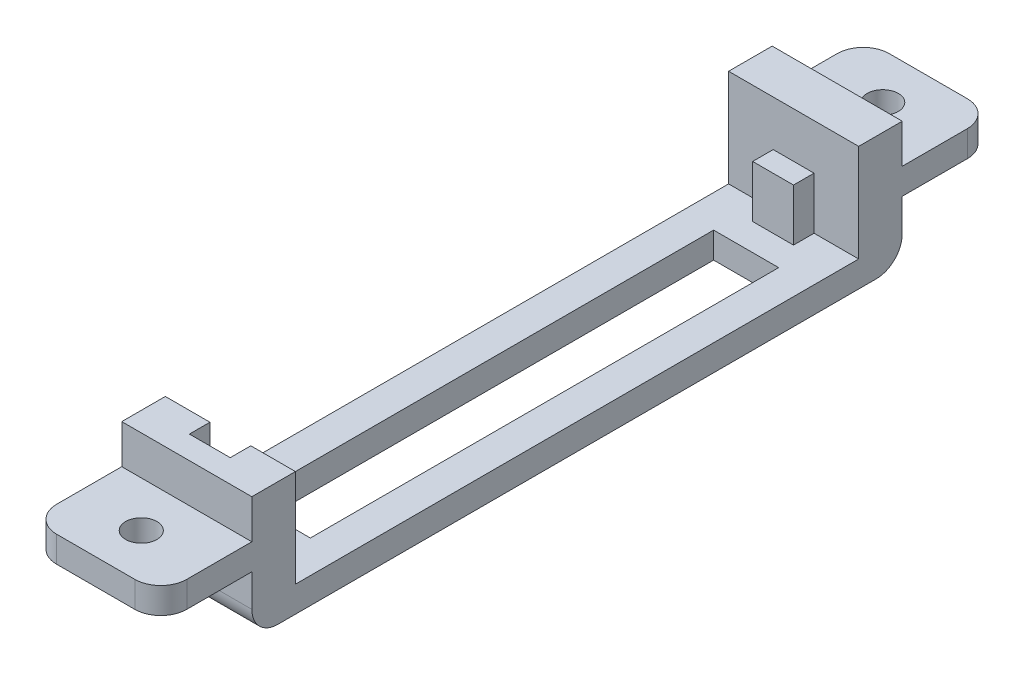
ISO-10303-21;
HEADER;
FILE_DESCRIPTION(('STEP AP214'),'2;1');
FILE_NAME('part.step','',(''),(''),'','','');
FILE_SCHEMA(('AUTOMOTIVE_DESIGN { 1 0 10303 214 1 1 1 1 }'));
ENDSEC;
DATA;
#1=APPLICATION_CONTEXT('core data for automotive mechanical design processes');
#2=APPLICATION_PROTOCOL_DEFINITION('international standard','automotive_design',2000,#1);
#3=PRODUCT_CONTEXT('',#1,'mechanical');
#4=PRODUCT('Part','Part','',(#3));
#5=PRODUCT_RELATED_PRODUCT_CATEGORY('part','',(#4));
#6=PRODUCT_DEFINITION_FORMATION('','',#4);
#7=PRODUCT_DEFINITION_CONTEXT('part definition',#1,'design');
#8=PRODUCT_DEFINITION('design','',#6,#7);
#9=PRODUCT_DEFINITION_SHAPE('','',#8);
#10=(LENGTH_UNIT() NAMED_UNIT(*) SI_UNIT(.MILLI.,.METRE.));
#11=(NAMED_UNIT(*) PLANE_ANGLE_UNIT() SI_UNIT($,.RADIAN.));
#12=(NAMED_UNIT(*) SI_UNIT($,.STERADIAN.) SOLID_ANGLE_UNIT());
#13=UNCERTAINTY_MEASURE_WITH_UNIT(LENGTH_MEASURE(1.E-05),#10,'distance_accuracy_value','');
#14=(GEOMETRIC_REPRESENTATION_CONTEXT(3) GLOBAL_UNCERTAINTY_ASSIGNED_CONTEXT((#13)) GLOBAL_UNIT_ASSIGNED_CONTEXT((#10,
#11,#12)) REPRESENTATION_CONTEXT('',''));
#15=CARTESIAN_POINT('',(0.,0.,0.));
#16=DIRECTION('',(0.,0.,1.));
#17=DIRECTION('',(1.,0.,0.));
#18=AXIS2_PLACEMENT_3D('',#15,#16,#17);
#19=CARTESIAN_POINT('',(-6.35,2.54,31.75));
#20=DIRECTION('',(0.,0.,-1.));
#21=DIRECTION('',(-1.,0.,0.));
#22=AXIS2_PLACEMENT_3D('',#19,#20,#21);
#23=PLANE('',#22);
#24=DIRECTION('',(-1.,0.,0.));
#25=VECTOR('',#24,1.);
#26=CARTESIAN_POINT('',(6.35,8.255,31.75));
#27=LINE('',#26,#25);
#28=CARTESIAN_POINT('',(6.35,8.255,31.75));
#29=VERTEX_POINT('',#28);
#30=CARTESIAN_POINT('',(-6.35,8.255,31.75));
#31=VERTEX_POINT('',#30);
#32=EDGE_CURVE('E363',#29,#31,#27,.T.);
#33=ORIENTED_EDGE('',*,*,#32,.F.);
#34=DIRECTION('',(0.,-1.,0.));
#35=VECTOR('',#34,1.);
#36=CARTESIAN_POINT('',(6.35,2.54,31.75));
#37=LINE('',#36,#35);
#38=CARTESIAN_POINT('',(6.35000000000002,12.065,31.75));
#39=VERTEX_POINT('',#38);
#40=EDGE_CURVE('E278',#39,#29,#37,.T.);
#41=ORIENTED_EDGE('',*,*,#40,.F.);
#42=DIRECTION('',(1.,0.,0.));
#43=VECTOR('',#42,1.);
#44=CARTESIAN_POINT('',(-6.35,12.065,31.75));
#45=LINE('',#44,#43);
#46=CARTESIAN_POINT('',(-6.35,12.065,31.75));
#47=VERTEX_POINT('',#46);
#48=EDGE_CURVE('E409',#47,#39,#45,.T.);
#49=ORIENTED_EDGE('',*,*,#48,.F.);
#50=DIRECTION('',(0.,-1.,0.));
#51=VECTOR('',#50,1.);
#52=CARTESIAN_POINT('',(-6.35,2.54,31.75));
#53=LINE('',#52,#51);
#54=EDGE_CURVE('E289',#47,#31,#53,.T.);
#55=ORIENTED_EDGE('',*,*,#54,.T.);
#56=EDGE_LOOP('',(#33,#41,#49,#55));
#57=FACE_BOUND('',#56,.T.);
#58=ADVANCED_FACE('F32',(#57),#23,.F.);
#59=CARTESIAN_POINT('',(-6.35,2.54,-31.75));
#60=DIRECTION('',(0.,0.,1.));
#61=DIRECTION('',(1.,0.,0.));
#62=AXIS2_PLACEMENT_3D('',#59,#60,#61);
#63=PLANE('',#62);
#64=DIRECTION('',(1.,0.,0.));
#65=VECTOR('',#64,1.);
#66=CARTESIAN_POINT('',(6.35,8.255,-31.75));
#67=LINE('',#66,#65);
#68=CARTESIAN_POINT('',(-6.35,8.255,-31.75));
#69=VERTEX_POINT('',#68);
#70=CARTESIAN_POINT('',(6.35,8.255,-31.75));
#71=VERTEX_POINT('',#70);
#72=EDGE_CURVE('E376',#69,#71,#67,.T.);
#73=ORIENTED_EDGE('',*,*,#72,.F.);
#74=DIRECTION('',(0.,-1.,0.));
#75=VECTOR('',#74,1.);
#76=CARTESIAN_POINT('',(-6.35,2.54,-31.75));
#77=LINE('',#76,#75);
#78=CARTESIAN_POINT('',(-6.35,12.065,-31.75));
#79=VERTEX_POINT('',#78);
#80=EDGE_CURVE('E293',#79,#69,#77,.T.);
#81=ORIENTED_EDGE('',*,*,#80,.F.);
#82=DIRECTION('',(-1.,0.,0.));
#83=VECTOR('',#82,1.);
#84=CARTESIAN_POINT('',(-6.35,12.065,-31.75));
#85=LINE('',#84,#83);
#86=CARTESIAN_POINT('',(6.35,12.065,-31.75));
#87=VERTEX_POINT('',#86);
#88=EDGE_CURVE('E463',#87,#79,#85,.T.);
#89=ORIENTED_EDGE('',*,*,#88,.F.);
#90=DIRECTION('',(0.,-1.,0.));
#91=VECTOR('',#90,1.);
#92=CARTESIAN_POINT('',(6.35,2.54,-31.75));
#93=LINE('',#92,#91);
#94=EDGE_CURVE('E297',#87,#71,#93,.T.);
#95=ORIENTED_EDGE('',*,*,#94,.T.);
#96=EDGE_LOOP('',(#73,#81,#89,#95));
#97=FACE_BOUND('',#96,.T.);
#98=ADVANCED_FACE('F572',(#97),#63,.F.);
#99=CARTESIAN_POINT('',(0.,2.54,0.));
#100=DIRECTION('',(0.,-1.,0.));
#101=DIRECTION('',(0.,0.,-1.));
#102=AXIS2_PLACEMENT_3D('',#99,#100,#101);
#103=PLANE('',#102);
#104=DIRECTION('',(0.,0.,-1.));
#105=VECTOR('',#104,1.);
#106=CARTESIAN_POINT('',(3.175,2.54,22.86));
#107=LINE('',#106,#105);
#108=CARTESIAN_POINT('',(3.175,2.54,22.86));
#109=VERTEX_POINT('',#108);
#110=CARTESIAN_POINT('',(3.175,2.54,-22.86));
#111=VERTEX_POINT('',#110);
#112=EDGE_CURVE('E494',#109,#111,#107,.T.);
#113=ORIENTED_EDGE('',*,*,#112,.F.);
#114=DIRECTION('',(1.,0.,0.));
#115=VECTOR('',#114,1.);
#116=CARTESIAN_POINT('',(-3.175,2.54,22.86));
#117=LINE('',#116,#115);
#118=CARTESIAN_POINT('',(-3.175,2.54,22.86));
#119=VERTEX_POINT('',#118);
#120=EDGE_CURVE('E502',#119,#109,#117,.T.);
#121=ORIENTED_EDGE('',*,*,#120,.F.);
#122=DIRECTION('',(0.,0.,1.));
#123=VECTOR('',#122,1.);
#124=CARTESIAN_POINT('',(-3.175,2.54,22.86));
#125=LINE('',#124,#123);
#126=CARTESIAN_POINT('',(-3.175,2.54,-22.86));
#127=VERTEX_POINT('',#126);
#128=EDGE_CURVE('E499',#127,#119,#125,.T.);
#129=ORIENTED_EDGE('',*,*,#128,.F.);
#130=DIRECTION('',(-1.,0.,0.));
#131=VECTOR('',#130,1.);
#132=CARTESIAN_POINT('',(-3.175,2.54,-22.86));
#133=LINE('',#132,#131);
#134=EDGE_CURVE('E496',#111,#127,#133,.T.);
#135=ORIENTED_EDGE('',*,*,#134,.F.);
#136=EDGE_LOOP('',(#113,#121,#129,#135));
#137=FACE_BOUND('',#136,.T.);
#138=DIRECTION('',(-1.,0.,0.));
#139=VECTOR('',#138,1.);
#140=CARTESIAN_POINT('',(-1.99389999999998,2.54,27.4955));
#141=LINE('',#140,#139);
#142=CARTESIAN_POINT('',(-1.99389999999998,2.54,27.4955));
#143=VERTEX_POINT('',#142);
#144=CARTESIAN_POINT('',(-6.35,2.54,27.4955));
#145=VERTEX_POINT('',#144);
#146=EDGE_CURVE('E401',#143,#145,#141,.T.);
#147=ORIENTED_EDGE('',*,*,#146,.F.);
#148=DIRECTION('',(0.,0.,-1.));
#149=VECTOR('',#148,1.);
#150=CARTESIAN_POINT('',(-1.9939,2.54,29.5021));
#151=LINE('',#150,#149);
#152=CARTESIAN_POINT('',(-1.9939,2.54,29.5021));
#153=VERTEX_POINT('',#152);
#154=EDGE_CURVE('E406',#153,#143,#151,.T.);
#155=ORIENTED_EDGE('',*,*,#154,.F.);
#156=DIRECTION('',(-1.,0.,0.));
#157=VECTOR('',#156,1.);
#158=CARTESIAN_POINT('',(1.9939,2.54,29.5021));
#159=LINE('',#158,#157);
#160=CARTESIAN_POINT('',(1.9939,2.54,29.5021));
#161=VERTEX_POINT('',#160);
#162=EDGE_CURVE('E431',#161,#153,#159,.T.);
#163=ORIENTED_EDGE('',*,*,#162,.F.);
#164=DIRECTION('',(0.,0.,1.));
#165=VECTOR('',#164,1.);
#166=CARTESIAN_POINT('',(1.9939,2.54,27.4955));
#167=LINE('',#166,#165);
#168=CARTESIAN_POINT('',(1.9939,2.54,27.4955));
#169=VERTEX_POINT('',#168);
#170=EDGE_CURVE('E428',#169,#161,#167,.T.);
#171=ORIENTED_EDGE('',*,*,#170,.F.);
#172=DIRECTION('',(-1.,0.,0.));
#173=VECTOR('',#172,1.);
#174=CARTESIAN_POINT('',(6.35000000000002,2.54,27.4955));
#175=LINE('',#174,#173);
#176=CARTESIAN_POINT('',(6.35,2.54,27.4955));
#177=VERTEX_POINT('',#176);
#178=EDGE_CURVE('E425',#177,#169,#175,.T.);
#179=ORIENTED_EDGE('',*,*,#178,.F.);
#180=DIRECTION('',(0.,0.,-1.));
#181=VECTOR('',#180,1.);
#182=CARTESIAN_POINT('',(6.35,2.54,31.75));
#183=LINE('',#182,#181);
#184=CARTESIAN_POINT('',(6.35,2.54,-27.4955));
#185=VERTEX_POINT('',#184);
#186=EDGE_CURVE('E283',#177,#185,#183,.T.);
#187=ORIENTED_EDGE('',*,*,#186,.T.);
#188=DIRECTION('',(1.,0.,0.));
#189=VECTOR('',#188,1.);
#190=CARTESIAN_POINT('',(6.35,2.54,-27.4955));
#191=LINE('',#190,#189);
#192=CARTESIAN_POINT('',(1.9939,2.54,-27.4955));
#193=VERTEX_POINT('',#192);
#194=EDGE_CURVE('E458',#193,#185,#191,.T.);
#195=ORIENTED_EDGE('',*,*,#194,.F.);
#196=DIRECTION('',(0.,0.,-1.));
#197=VECTOR('',#196,1.);
#198=CARTESIAN_POINT('',(1.9939,2.54,-27.4955));
#199=LINE('',#198,#197);
#200=CARTESIAN_POINT('',(1.9939,2.54,-25.4889));
#201=VERTEX_POINT('',#200);
#202=EDGE_CURVE('E475',#201,#193,#199,.T.);
#203=ORIENTED_EDGE('',*,*,#202,.F.);
#204=DIRECTION('',(1.,0.,0.));
#205=VECTOR('',#204,1.);
#206=CARTESIAN_POINT('',(1.9939,2.54,-25.4889));
#207=LINE('',#206,#205);
#208=CARTESIAN_POINT('',(-1.9939,2.54,-25.4889));
#209=VERTEX_POINT('',#208);
#210=EDGE_CURVE('E472',#209,#201,#207,.T.);
#211=ORIENTED_EDGE('',*,*,#210,.F.);
#212=DIRECTION('',(0.,0.,1.));
#213=VECTOR('',#212,1.);
#214=CARTESIAN_POINT('',(-1.9939,2.54,-25.4889));
#215=LINE('',#214,#213);
#216=CARTESIAN_POINT('',(-1.9939,2.54,-27.4955));
#217=VERTEX_POINT('',#216);
#218=EDGE_CURVE('E469',#217,#209,#215,.T.);
#219=ORIENTED_EDGE('',*,*,#218,.F.);
#220=DIRECTION('',(1.,0.,0.));
#221=VECTOR('',#220,1.);
#222=CARTESIAN_POINT('',(-1.9939,2.54,-27.4955));
#223=LINE('',#222,#221);
#224=CARTESIAN_POINT('',(-6.35,2.54,-27.4955));
#225=VERTEX_POINT('',#224);
#226=EDGE_CURVE('E453',#225,#217,#223,.T.);
#227=ORIENTED_EDGE('',*,*,#226,.F.);
#228=DIRECTION('',(0.,0.,1.));
#229=VECTOR('',#228,1.);
#230=CARTESIAN_POINT('',(-6.35,2.54,31.75));
#231=LINE('',#230,#229);
#232=EDGE_CURVE('E279',#225,#145,#231,.T.);
#233=ORIENTED_EDGE('',*,*,#232,.T.);
#234=EDGE_LOOP('',(#147,#155,#163,#171,#179,#187,#195,#203,#211,#219,#227,#233));
#235=FACE_BOUND('',#234,.T.);
#236=ADVANCED_FACE('F586',(#137,#235),#103,.F.);
#237=CARTESIAN_POINT('',(0.,0.,0.));
#238=DIRECTION('',(0.,-1.,0.));
#239=DIRECTION('',(0.,0.,-1.));
#240=AXIS2_PLACEMENT_3D('',#237,#238,#239);
#241=PLANE('',#240);
#242=DIRECTION('',(0.,0.,1.));
#243=VECTOR('',#242,1.);
#244=CARTESIAN_POINT('',(-6.35,0.,31.75));
#245=LINE('',#244,#243);
#246=CARTESIAN_POINT('',(-6.35,0.,-29.21));
#247=VERTEX_POINT('',#246);
#248=CARTESIAN_POINT('',(-6.35,0.,29.21));
#249=VERTEX_POINT('',#248);
#250=EDGE_CURVE('E287',#247,#249,#245,.T.);
#251=ORIENTED_EDGE('',*,*,#250,.F.);
#252=DIRECTION('',(-1.,0.,0.));
#253=VECTOR('',#252,1.);
#254=CARTESIAN_POINT('',(6.35,0.,-29.21));
#255=LINE('',#254,#253);
#256=CARTESIAN_POINT('',(6.35,0.,-29.21));
#257=VERTEX_POINT('',#256);
#258=EDGE_CURVE('E335',#247,#257,#255,.F.);
#259=ORIENTED_EDGE('',*,*,#258,.T.);
#260=DIRECTION('',(0.,0.,-1.));
#261=VECTOR('',#260,1.);
#262=CARTESIAN_POINT('',(6.35,0.,31.75));
#263=LINE('',#262,#261);
#264=CARTESIAN_POINT('',(6.35,0.,29.21));
#265=VERTEX_POINT('',#264);
#266=EDGE_CURVE('E524',#265,#257,#263,.T.);
#267=ORIENTED_EDGE('',*,*,#266,.F.);
#268=DIRECTION('',(1.,0.,0.));
#269=VECTOR('',#268,1.);
#270=CARTESIAN_POINT('',(-6.35,0.,29.21));
#271=LINE('',#270,#269);
#272=EDGE_CURVE('E333',#265,#249,#271,.F.);
#273=ORIENTED_EDGE('',*,*,#272,.T.);
#274=EDGE_LOOP('',(#251,#259,#267,#273));
#275=FACE_BOUND('',#274,.T.);
#276=DIRECTION('',(1.,0.,0.));
#277=VECTOR('',#276,1.);
#278=CARTESIAN_POINT('',(-3.175,0.,22.86));
#279=LINE('',#278,#277);
#280=CARTESIAN_POINT('',(-3.175,0.,22.86));
#281=VERTEX_POINT('',#280);
#282=CARTESIAN_POINT('',(3.175,0.,22.86));
#283=VERTEX_POINT('',#282);
#284=EDGE_CURVE('E497',#281,#283,#279,.T.);
#285=ORIENTED_EDGE('',*,*,#284,.T.);
#286=DIRECTION('',(0.,0.,-1.));
#287=VECTOR('',#286,1.);
#288=CARTESIAN_POINT('',(3.175,0.,22.86));
#289=LINE('',#288,#287);
#290=CARTESIAN_POINT('',(3.175,0.,-22.86));
#291=VERTEX_POINT('',#290);
#292=EDGE_CURVE('E493',#283,#291,#289,.T.);
#293=ORIENTED_EDGE('',*,*,#292,.T.);
#294=DIRECTION('',(-1.,0.,0.));
#295=VECTOR('',#294,1.);
#296=CARTESIAN_POINT('',(-3.175,0.,-22.86));
#297=LINE('',#296,#295);
#298=CARTESIAN_POINT('',(-3.175,0.,-22.86));
#299=VERTEX_POINT('',#298);
#300=EDGE_CURVE('E507',#291,#299,#297,.T.);
#301=ORIENTED_EDGE('',*,*,#300,.T.);
#302=DIRECTION('',(0.,0.,1.));
#303=VECTOR('',#302,1.);
#304=CARTESIAN_POINT('',(-3.175,0.,22.86));
#305=LINE('',#304,#303);
#306=EDGE_CURVE('E510',#299,#281,#305,.T.);
#307=ORIENTED_EDGE('',*,*,#306,.T.);
#308=EDGE_LOOP('',(#285,#293,#301,#307));
#309=FACE_BOUND('',#308,.T.);
#310=ADVANCED_FACE('F537',(#275,#309),#241,.T.);
#311=CARTESIAN_POINT('',(6.35,2.54,31.75));
#312=DIRECTION('',(-1.,0.,0.));
#313=DIRECTION('',(0.,0.,1.));
#314=AXIS2_PLACEMENT_3D('',#311,#312,#313);
#315=PLANE('',#314);
#316=DIRECTION('',(0.,0.,-1.));
#317=VECTOR('',#316,1.);
#318=CARTESIAN_POINT('',(6.35,5.715,-40.64));
#319=LINE('',#318,#317);
#320=CARTESIAN_POINT('',(6.35,5.715,-31.75));
#321=VERTEX_POINT('',#320);
#322=CARTESIAN_POINT('',(6.35,5.715,-38.1));
#323=VERTEX_POINT('',#322);
#324=EDGE_CURVE('E373',#321,#323,#319,.T.);
#325=ORIENTED_EDGE('',*,*,#324,.T.);
#326=DIRECTION('',(0.,1.,0.));
#327=VECTOR('',#326,1.);
#328=CARTESIAN_POINT('',(6.35,8.255,-38.1));
#329=LINE('',#328,#327);
#330=CARTESIAN_POINT('',(6.35,8.255,-38.1));
#331=VERTEX_POINT('',#330);
#332=EDGE_CURVE('E305',#323,#331,#329,.T.);
#333=ORIENTED_EDGE('',*,*,#332,.T.);
#334=DIRECTION('',(0.,0.,-1.));
#335=VECTOR('',#334,1.);
#336=CARTESIAN_POINT('',(6.35,8.255,-40.64));
#337=LINE('',#336,#335);
#338=EDGE_CURVE('E370',#71,#331,#337,.T.);
#339=ORIENTED_EDGE('',*,*,#338,.F.);
#340=ORIENTED_EDGE('',*,*,#94,.F.);
#341=DIRECTION('',(0.,0.,-1.));
#342=VECTOR('',#341,1.);
#343=CARTESIAN_POINT('',(6.35,12.065,-31.75));
#344=LINE('',#343,#342);
#345=CARTESIAN_POINT('',(6.35,12.065,-27.4955));
#346=VERTEX_POINT('',#345);
#347=EDGE_CURVE('E460',#346,#87,#344,.T.);
#348=ORIENTED_EDGE('',*,*,#347,.F.);
#349=DIRECTION('',(0.,-1.,0.));
#350=VECTOR('',#349,1.);
#351=CARTESIAN_POINT('',(6.35,12.065,-27.4955));
#352=LINE('',#351,#350);
#353=EDGE_CURVE('E466',#346,#185,#352,.T.);
#354=ORIENTED_EDGE('',*,*,#353,.T.);
#355=ORIENTED_EDGE('',*,*,#186,.F.);
#356=DIRECTION('',(0.,-1.,0.));
#357=VECTOR('',#356,1.);
#358=CARTESIAN_POINT('',(6.35000000000002,12.065,27.4955));
#359=LINE('',#358,#357);
#360=CARTESIAN_POINT('',(6.35000000000002,12.065,27.4955));
#361=VERTEX_POINT('',#360);
#362=EDGE_CURVE('E447',#361,#177,#359,.T.);
#363=ORIENTED_EDGE('',*,*,#362,.F.);
#364=DIRECTION('',(0.,0.,-1.));
#365=VECTOR('',#364,1.);
#366=CARTESIAN_POINT('',(6.35000000000002,12.065,31.75));
#367=LINE('',#366,#365);
#368=EDGE_CURVE('E412',#39,#361,#367,.T.);
#369=ORIENTED_EDGE('',*,*,#368,.F.);
#370=ORIENTED_EDGE('',*,*,#40,.T.);
#371=DIRECTION('',(0.,0.,-1.));
#372=VECTOR('',#371,1.);
#373=CARTESIAN_POINT('',(6.35,8.255,40.64));
#374=LINE('',#373,#372);
#375=CARTESIAN_POINT('',(6.35,8.255,38.1));
#376=VERTEX_POINT('',#375);
#377=EDGE_CURVE('E272',#376,#29,#374,.T.);
#378=ORIENTED_EDGE('',*,*,#377,.F.);
#379=DIRECTION('',(0.,1.,0.));
#380=VECTOR('',#379,1.);
#381=CARTESIAN_POINT('',(6.35,5.715,38.1));
#382=LINE('',#381,#380);
#383=CARTESIAN_POINT('',(6.35,5.715,38.1));
#384=VERTEX_POINT('',#383);
#385=EDGE_CURVE('E260',#376,#384,#382,.F.);
#386=ORIENTED_EDGE('',*,*,#385,.T.);
#387=DIRECTION('',(0.,0.,-1.));
#388=VECTOR('',#387,1.);
#389=CARTESIAN_POINT('',(6.35,5.715,40.64));
#390=LINE('',#389,#388);
#391=CARTESIAN_POINT('',(6.35,5.715,31.75));
#392=VERTEX_POINT('',#391);
#393=EDGE_CURVE('E252',#384,#392,#390,.T.);
#394=ORIENTED_EDGE('',*,*,#393,.T.);
#395=CARTESIAN_POINT('',(6.35,2.54,31.75));
#396=VERTEX_POINT('',#395);
#397=EDGE_CURVE('E257',#392,#396,#37,.T.);
#398=ORIENTED_EDGE('',*,*,#397,.T.);
#399=CARTESIAN_POINT('',(6.35,2.54,29.21));
#400=DIRECTION('',(-1.,0.,0.));
#401=DIRECTION('',(0.,0.,1.));
#402=AXIS2_PLACEMENT_3D('',#399,#400,#401);
#403=CIRCLE('',#402,2.54);
#404=EDGE_CURVE('E301',#396,#265,#403,.F.);
#405=ORIENTED_EDGE('',*,*,#404,.T.);
#406=ORIENTED_EDGE('',*,*,#266,.T.);
#407=CARTESIAN_POINT('',(6.35,2.54,-29.21));
#408=DIRECTION('',(-1.,0.,0.));
#409=DIRECTION('',(0.,0.,1.));
#410=AXIS2_PLACEMENT_3D('',#407,#408,#409);
#411=CIRCLE('',#410,2.54);
#412=CARTESIAN_POINT('',(6.35,2.54,-31.75));
#413=VERTEX_POINT('',#412);
#414=EDGE_CURVE('E303',#257,#413,#411,.F.);
#415=ORIENTED_EDGE('',*,*,#414,.T.);
#416=EDGE_CURVE('E296',#321,#413,#93,.T.);
#417=ORIENTED_EDGE('',*,*,#416,.F.);
#418=EDGE_LOOP('',(#325,#333,#339,#340,#348,#354,#355,#363,#369,#370,#378,#386,#394,#398,#405,
#406,#415,#417));
#419=FACE_BOUND('',#418,.T.);
#420=ADVANCED_FACE('F255',(#419),#315,.F.);
#421=ORIENTED_EDGE('',*,*,#416,.T.);
#422=DIRECTION('',(-1.,0.,0.));
#423=VECTOR('',#422,1.);
#424=CARTESIAN_POINT('',(-6.35,2.54,-31.75));
#425=LINE('',#424,#423);
#426=CARTESIAN_POINT('',(-6.35,2.54,-31.75));
#427=VERTEX_POINT('',#426);
#428=EDGE_CURVE('E330',#413,#427,#425,.T.);
#429=ORIENTED_EDGE('',*,*,#428,.T.);
#430=CARTESIAN_POINT('',(-6.35,5.715,-31.75));
#431=VERTEX_POINT('',#430);
#432=EDGE_CURVE('E292',#431,#427,#77,.T.);
#433=ORIENTED_EDGE('',*,*,#432,.F.);
#434=DIRECTION('',(1.,0.,0.));
#435=VECTOR('',#434,1.);
#436=CARTESIAN_POINT('',(6.35,5.715,-31.75));
#437=LINE('',#436,#435);
#438=EDGE_CURVE('E381',#431,#321,#437,.T.);
#439=ORIENTED_EDGE('',*,*,#438,.T.);
#440=EDGE_LOOP('',(#421,#429,#433,#439));
#441=FACE_BOUND('',#440,.T.);
#442=ADVANCED_FACE('F545',(#441),#63,.F.);
#443=CARTESIAN_POINT('',(-6.35,2.54,31.75));
#444=DIRECTION('',(1.,0.,0.));
#445=DIRECTION('',(0.,0.,-1.));
#446=AXIS2_PLACEMENT_3D('',#443,#444,#445);
#447=PLANE('',#446);
#448=DIRECTION('',(0.,0.,1.));
#449=VECTOR('',#448,1.);
#450=CARTESIAN_POINT('',(-6.35,8.255,-31.75));
#451=LINE('',#450,#449);
#452=CARTESIAN_POINT('',(-6.35,8.255,-38.1));
#453=VERTEX_POINT('',#452);
#454=EDGE_CURVE('E390',#453,#69,#451,.T.);
#455=ORIENTED_EDGE('',*,*,#454,.F.);
#456=DIRECTION('',(0.,1.,0.));
#457=VECTOR('',#456,1.);
#458=CARTESIAN_POINT('',(-6.35,5.715,-38.1));
#459=LINE('',#458,#457);
#460=CARTESIAN_POINT('',(-6.35,5.715,-38.1));
#461=VERTEX_POINT('',#460);
#462=EDGE_CURVE('E328',#453,#461,#459,.F.);
#463=ORIENTED_EDGE('',*,*,#462,.T.);
#464=DIRECTION('',(0.,0.,1.));
#465=VECTOR('',#464,1.);
#466=CARTESIAN_POINT('',(-6.35,5.715,-31.75));
#467=LINE('',#466,#465);
#468=EDGE_CURVE('E379',#461,#431,#467,.T.);
#469=ORIENTED_EDGE('',*,*,#468,.T.);
#470=ORIENTED_EDGE('',*,*,#432,.T.);
#471=CARTESIAN_POINT('',(-6.35,2.54,-29.21));
#472=DIRECTION('',(1.,0.,0.));
#473=DIRECTION('',(0.,0.,-1.));
#474=AXIS2_PLACEMENT_3D('',#471,#472,#473);
#475=CIRCLE('',#474,2.54);
#476=EDGE_CURVE('E326',#427,#247,#475,.F.);
#477=ORIENTED_EDGE('',*,*,#476,.T.);
#478=ORIENTED_EDGE('',*,*,#250,.T.);
#479=CARTESIAN_POINT('',(-6.35,2.54,29.21));
#480=DIRECTION('',(1.,0.,0.));
#481=DIRECTION('',(0.,0.,-1.));
#482=AXIS2_PLACEMENT_3D('',#479,#480,#481);
#483=CIRCLE('',#482,2.54);
#484=CARTESIAN_POINT('',(-6.35,2.54,31.75));
#485=VERTEX_POINT('',#484);
#486=EDGE_CURVE('E324',#249,#485,#483,.F.);
#487=ORIENTED_EDGE('',*,*,#486,.T.);
#488=CARTESIAN_POINT('',(-6.35,5.715,31.75));
#489=VERTEX_POINT('',#488);
#490=EDGE_CURVE('E282',#489,#485,#53,.T.);
#491=ORIENTED_EDGE('',*,*,#490,.F.);
#492=DIRECTION('',(0.,0.,1.));
#493=VECTOR('',#492,1.);
#494=CARTESIAN_POINT('',(-6.35,5.715,31.75));
#495=LINE('',#494,#493);
#496=CARTESIAN_POINT('',(-6.35,5.715,38.1));
#497=VERTEX_POINT('',#496);
#498=EDGE_CURVE('E268',#489,#497,#495,.T.);
#499=ORIENTED_EDGE('',*,*,#498,.T.);
#500=DIRECTION('',(0.,1.,0.));
#501=VECTOR('',#500,1.);
#502=CARTESIAN_POINT('',(-6.35,8.255,38.1));
#503=LINE('',#502,#501);
#504=CARTESIAN_POINT('',(-6.35,8.255,38.1));
#505=VERTEX_POINT('',#504);
#506=EDGE_CURVE('E321',#497,#505,#503,.T.);
#507=ORIENTED_EDGE('',*,*,#506,.T.);
#508=DIRECTION('',(0.,0.,1.));
#509=VECTOR('',#508,1.);
#510=CARTESIAN_POINT('',(-6.35,8.255,31.75));
#511=LINE('',#510,#509);
#512=EDGE_CURVE('E358',#31,#505,#511,.T.);
#513=ORIENTED_EDGE('',*,*,#512,.F.);
#514=ORIENTED_EDGE('',*,*,#54,.F.);
#515=DIRECTION('',(0.,0.,1.));
#516=VECTOR('',#515,1.);
#517=CARTESIAN_POINT('',(-6.35,12.065,27.4955));
#518=LINE('',#517,#516);
#519=CARTESIAN_POINT('',(-6.35,12.065,27.4955));
#520=VERTEX_POINT('',#519);
#521=EDGE_CURVE('E405',#520,#47,#518,.T.);
#522=ORIENTED_EDGE('',*,*,#521,.F.);
#523=DIRECTION('',(0.,-1.,0.));
#524=VECTOR('',#523,1.);
#525=CARTESIAN_POINT('',(-6.35,12.065,27.4955));
#526=LINE('',#525,#524);
#527=EDGE_CURVE('E450',#520,#145,#526,.T.);
#528=ORIENTED_EDGE('',*,*,#527,.T.);
#529=ORIENTED_EDGE('',*,*,#232,.F.);
#530=DIRECTION('',(0.,-1.,0.));
#531=VECTOR('',#530,1.);
#532=CARTESIAN_POINT('',(-6.35,12.065,-27.4955));
#533=LINE('',#532,#531);
#534=CARTESIAN_POINT('',(-6.35,12.065,-27.4955));
#535=VERTEX_POINT('',#534);
#536=EDGE_CURVE('E490',#535,#225,#533,.T.);
#537=ORIENTED_EDGE('',*,*,#536,.F.);
#538=DIRECTION('',(0.,0.,1.));
#539=VECTOR('',#538,1.);
#540=CARTESIAN_POINT('',(-6.35,12.065,-27.4955));
#541=LINE('',#540,#539);
#542=EDGE_CURVE('E454',#79,#535,#541,.T.);
#543=ORIENTED_EDGE('',*,*,#542,.F.);
#544=ORIENTED_EDGE('',*,*,#80,.T.);
#545=EDGE_LOOP('',(#455,#463,#469,#470,#477,#478,#487,#491,#499,#507,#513,#514,#522,#528,#529,
#537,#543,#544));
#546=FACE_BOUND('',#545,.T.);
#547=ADVANCED_FACE('F350',(#546),#447,.F.);
#548=ORIENTED_EDGE('',*,*,#490,.T.);
#549=DIRECTION('',(1.,0.,0.));
#550=VECTOR('',#549,1.);
#551=CARTESIAN_POINT('',(6.35,2.54,31.75));
#552=LINE('',#551,#550);
#553=EDGE_CURVE('E277',#485,#396,#552,.T.);
#554=ORIENTED_EDGE('',*,*,#553,.T.);
#555=ORIENTED_EDGE('',*,*,#397,.F.);
#556=DIRECTION('',(-1.,0.,0.));
#557=VECTOR('',#556,1.);
#558=CARTESIAN_POINT('',(6.35,5.715,31.75));
#559=LINE('',#558,#557);
#560=EDGE_CURVE('E265',#392,#489,#559,.T.);
#561=ORIENTED_EDGE('',*,*,#560,.T.);
#562=EDGE_LOOP('',(#548,#554,#555,#561));
#563=FACE_BOUND('',#562,.T.);
#564=ADVANCED_FACE('F275',(#563),#23,.F.);
#565=CARTESIAN_POINT('',(3.175,2.54,22.86));
#566=DIRECTION('',(-1.,0.,0.));
#567=DIRECTION('',(0.,0.,1.));
#568=AXIS2_PLACEMENT_3D('',#565,#566,#567);
#569=PLANE('',#568);
#570=ORIENTED_EDGE('',*,*,#292,.F.);
#571=DIRECTION('',(0.,-1.,0.));
#572=VECTOR('',#571,1.);
#573=CARTESIAN_POINT('',(3.175,2.54,22.86));
#574=LINE('',#573,#572);
#575=EDGE_CURVE('E504',#109,#283,#574,.T.);
#576=ORIENTED_EDGE('',*,*,#575,.F.);
#577=ORIENTED_EDGE('',*,*,#112,.T.);
#578=DIRECTION('',(0.,-1.,0.));
#579=VECTOR('',#578,1.);
#580=CARTESIAN_POINT('',(3.175,2.54,-22.86));
#581=LINE('',#580,#579);
#582=EDGE_CURVE('E521',#111,#291,#581,.T.);
#583=ORIENTED_EDGE('',*,*,#582,.T.);
#584=EDGE_LOOP('',(#570,#576,#577,#583));
#585=FACE_BOUND('',#584,.T.);
#586=ADVANCED_FACE('F659',(#585),#569,.T.);
#587=CARTESIAN_POINT('',(-3.175,2.54,-22.86));
#588=DIRECTION('',(0.,0.,1.));
#589=DIRECTION('',(1.,0.,0.));
#590=AXIS2_PLACEMENT_3D('',#587,#588,#589);
#591=PLANE('',#590);
#592=ORIENTED_EDGE('',*,*,#300,.F.);
#593=ORIENTED_EDGE('',*,*,#582,.F.);
#594=ORIENTED_EDGE('',*,*,#134,.T.);
#595=DIRECTION('',(0.,-1.,0.));
#596=VECTOR('',#595,1.);
#597=CARTESIAN_POINT('',(-3.175,2.54,-22.86));
#598=LINE('',#597,#596);
#599=EDGE_CURVE('E519',#127,#299,#598,.T.);
#600=ORIENTED_EDGE('',*,*,#599,.T.);
#601=EDGE_LOOP('',(#592,#593,#594,#600));
#602=FACE_BOUND('',#601,.T.);
#603=ADVANCED_FACE('F664',(#602),#591,.T.);
#604=CARTESIAN_POINT('',(-3.175,2.54,22.86));
#605=DIRECTION('',(1.,0.,0.));
#606=DIRECTION('',(0.,0.,-1.));
#607=AXIS2_PLACEMENT_3D('',#604,#605,#606);
#608=PLANE('',#607);
#609=ORIENTED_EDGE('',*,*,#306,.F.);
#610=ORIENTED_EDGE('',*,*,#599,.F.);
#611=ORIENTED_EDGE('',*,*,#128,.T.);
#612=DIRECTION('',(0.,-1.,0.));
#613=VECTOR('',#612,1.);
#614=CARTESIAN_POINT('',(-3.175,2.54,22.86));
#615=LINE('',#614,#613);
#616=EDGE_CURVE('E517',#119,#281,#615,.T.);
#617=ORIENTED_EDGE('',*,*,#616,.T.);
#618=EDGE_LOOP('',(#609,#610,#611,#617));
#619=FACE_BOUND('',#618,.T.);
#620=ADVANCED_FACE('F942',(#619),#608,.T.);
#621=CARTESIAN_POINT('',(-3.175,2.54,22.86));
#622=DIRECTION('',(0.,0.,-1.));
#623=DIRECTION('',(-1.,0.,0.));
#624=AXIS2_PLACEMENT_3D('',#621,#622,#623);
#625=PLANE('',#624);
#626=ORIENTED_EDGE('',*,*,#284,.F.);
#627=ORIENTED_EDGE('',*,*,#616,.F.);
#628=ORIENTED_EDGE('',*,*,#120,.T.);
#629=ORIENTED_EDGE('',*,*,#575,.T.);
#630=EDGE_LOOP('',(#626,#627,#628,#629));
#631=FACE_BOUND('',#630,.T.);
#632=ADVANCED_FACE('F878',(#631),#625,.T.);
#633=CARTESIAN_POINT('',(-1.9939,12.065,-27.4955));
#634=DIRECTION('',(0.,0.,-1.));
#635=DIRECTION('',(-1.,0.,0.));
#636=AXIS2_PLACEMENT_3D('',#633,#634,#635);
#637=PLANE('',#636);
#638=ORIENTED_EDGE('',*,*,#226,.T.);
#639=DIRECTION('',(0.,-1.,0.));
#640=VECTOR('',#639,1.);
#641=CARTESIAN_POINT('',(-1.9939,12.065,-27.4955));
#642=LINE('',#641,#640);
#643=CARTESIAN_POINT('',(-1.9939,7.62,-27.4955));
#644=VERTEX_POINT('',#643);
#645=EDGE_CURVE('E488',#644,#217,#642,.T.);
#646=ORIENTED_EDGE('',*,*,#645,.F.);
#647=DIRECTION('',(-1.,0.,0.));
#648=VECTOR('',#647,1.);
#649=CARTESIAN_POINT('',(-1.9939,7.62,-27.4955));
#650=LINE('',#649,#648);
#651=CARTESIAN_POINT('',(1.9939,7.62,-27.4955));
#652=VERTEX_POINT('',#651);
#653=EDGE_CURVE('E399',#652,#644,#650,.T.);
#654=ORIENTED_EDGE('',*,*,#653,.F.);
#655=DIRECTION('',(0.,-1.,0.));
#656=VECTOR('',#655,1.);
#657=CARTESIAN_POINT('',(1.9939,12.065,-27.4955));
#658=LINE('',#657,#656);
#659=EDGE_CURVE('E482',#652,#193,#658,.T.);
#660=ORIENTED_EDGE('',*,*,#659,.T.);
#661=ORIENTED_EDGE('',*,*,#194,.T.);
#662=ORIENTED_EDGE('',*,*,#353,.F.);
#663=DIRECTION('',(1.,0.,0.));
#664=VECTOR('',#663,1.);
#665=CARTESIAN_POINT('',(-1.9939,12.065,-27.4955));
#666=LINE('',#665,#664);
#667=EDGE_CURVE('E457',#535,#346,#666,.T.);
#668=ORIENTED_EDGE('',*,*,#667,.F.);
#669=ORIENTED_EDGE('',*,*,#536,.T.);
#670=EDGE_LOOP('',(#638,#646,#654,#660,#661,#662,#668,#669));
#671=FACE_BOUND('',#670,.T.);
#672=ADVANCED_FACE('F580',(#671),#637,.F.);
#673=CARTESIAN_POINT('',(-1.9939,12.065,-25.4889));
#674=DIRECTION('',(1.,0.,0.));
#675=DIRECTION('',(0.,0.,-1.));
#676=AXIS2_PLACEMENT_3D('',#673,#674,#675);
#677=PLANE('',#676);
#678=DIRECTION('',(0.,-1.,0.));
#679=VECTOR('',#678,1.);
#680=CARTESIAN_POINT('',(-1.9939,12.065,-25.4889));
#681=LINE('',#680,#679);
#682=CARTESIAN_POINT('',(-1.9939,7.62,-25.4889));
#683=VERTEX_POINT('',#682);
#684=EDGE_CURVE('E486',#683,#209,#681,.T.);
#685=ORIENTED_EDGE('',*,*,#684,.F.);
#686=DIRECTION('',(0.,0.,1.));
#687=VECTOR('',#686,1.);
#688=CARTESIAN_POINT('',(-1.9939,7.62,-25.4889));
#689=LINE('',#688,#687);
#690=EDGE_CURVE('E384',#644,#683,#689,.T.);
#691=ORIENTED_EDGE('',*,*,#690,.F.);
#692=ORIENTED_EDGE('',*,*,#645,.T.);
#693=ORIENTED_EDGE('',*,*,#218,.T.);
#694=EDGE_LOOP('',(#685,#691,#692,#693));
#695=FACE_BOUND('',#694,.T.);
#696=ADVANCED_FACE('F598',(#695),#677,.F.);
#697=CARTESIAN_POINT('',(1.9939,12.065,-25.4889));
#698=DIRECTION('',(0.,0.,-1.));
#699=DIRECTION('',(-1.,0.,0.));
#700=AXIS2_PLACEMENT_3D('',#697,#698,#699);
#701=PLANE('',#700);
#702=DIRECTION('',(0.,-1.,0.));
#703=VECTOR('',#702,1.);
#704=CARTESIAN_POINT('',(1.9939,12.065,-25.4889));
#705=LINE('',#704,#703);
#706=CARTESIAN_POINT('',(1.9939,7.62,-25.4889));
#707=VERTEX_POINT('',#706);
#708=EDGE_CURVE('E484',#707,#201,#705,.T.);
#709=ORIENTED_EDGE('',*,*,#708,.F.);
#710=DIRECTION('',(1.,0.,0.));
#711=VECTOR('',#710,1.);
#712=CARTESIAN_POINT('',(-1.9939,7.62,-25.4889));
#713=LINE('',#712,#711);
#714=EDGE_CURVE('E395',#683,#707,#713,.T.);
#715=ORIENTED_EDGE('',*,*,#714,.F.);
#716=ORIENTED_EDGE('',*,*,#684,.T.);
#717=ORIENTED_EDGE('',*,*,#210,.T.);
#718=EDGE_LOOP('',(#709,#715,#716,#717));
#719=FACE_BOUND('',#718,.T.);
#720=ADVANCED_FACE('F594',(#719),#701,.F.);
#721=CARTESIAN_POINT('',(1.9939,12.065,-27.4955));
#722=DIRECTION('',(-1.,0.,0.));
#723=DIRECTION('',(0.,0.,1.));
#724=AXIS2_PLACEMENT_3D('',#721,#722,#723);
#725=PLANE('',#724);
#726=ORIENTED_EDGE('',*,*,#659,.F.);
#727=DIRECTION('',(0.,0.,-1.));
#728=VECTOR('',#727,1.);
#729=CARTESIAN_POINT('',(1.9939,7.62,-25.4889));
#730=LINE('',#729,#728);
#731=EDGE_CURVE('E397',#707,#652,#730,.T.);
#732=ORIENTED_EDGE('',*,*,#731,.F.);
#733=ORIENTED_EDGE('',*,*,#708,.T.);
#734=ORIENTED_EDGE('',*,*,#202,.T.);
#735=EDGE_LOOP('',(#726,#732,#733,#734));
#736=FACE_BOUND('',#735,.T.);
#737=ADVANCED_FACE('F589',(#736),#725,.F.);
#738=CARTESIAN_POINT('',(0.,12.065,0.));
#739=DIRECTION('',(0.,-1.,0.));
#740=DIRECTION('',(0.,0.,-1.));
#741=AXIS2_PLACEMENT_3D('',#738,#739,#740);
#742=PLANE('',#741);
#743=ORIENTED_EDGE('',*,*,#667,.T.);
#744=ORIENTED_EDGE('',*,*,#347,.T.);
#745=ORIENTED_EDGE('',*,*,#88,.T.);
#746=ORIENTED_EDGE('',*,*,#542,.T.);
#747=EDGE_LOOP('',(#743,#744,#745,#746));
#748=FACE_BOUND('',#747,.T.);
#749=ADVANCED_FACE('F574',(#748),#742,.F.);
#750=CARTESIAN_POINT('',(-1.99389999999998,12.065,27.4955));
#751=DIRECTION('',(0.,0.,1.));
#752=DIRECTION('',(1.,0.,0.));
#753=AXIS2_PLACEMENT_3D('',#750,#751,#752);
#754=PLANE('',#753);
#755=ORIENTED_EDGE('',*,*,#146,.T.);
#756=ORIENTED_EDGE('',*,*,#527,.F.);
#757=DIRECTION('',(-1.,0.,0.));
#758=VECTOR('',#757,1.);
#759=CARTESIAN_POINT('',(-1.99389999999998,12.065,27.4955));
#760=LINE('',#759,#758);
#761=CARTESIAN_POINT('',(-1.99389999999998,12.065,27.4955));
#762=VERTEX_POINT('',#761);
#763=EDGE_CURVE('E402',#762,#520,#760,.T.);
#764=ORIENTED_EDGE('',*,*,#763,.F.);
#765=DIRECTION('',(0.,-1.,0.));
#766=VECTOR('',#765,1.);
#767=CARTESIAN_POINT('',(-1.99389999999998,12.065,27.4955));
#768=LINE('',#767,#766);
#769=EDGE_CURVE('E422',#762,#143,#768,.T.);
#770=ORIENTED_EDGE('',*,*,#769,.T.);
#771=EDGE_LOOP('',(#755,#756,#764,#770));
#772=FACE_BOUND('',#771,.T.);
#773=ADVANCED_FACE('F605',(#772),#754,.F.);
#774=CARTESIAN_POINT('',(6.35000000000002,12.065,27.4955));
#775=DIRECTION('',(0.,0.,1.));
#776=DIRECTION('',(1.,0.,0.));
#777=AXIS2_PLACEMENT_3D('',#774,#775,#776);
#778=PLANE('',#777);
#779=ORIENTED_EDGE('',*,*,#178,.T.);
#780=DIRECTION('',(0.,-1.,0.));
#781=VECTOR('',#780,1.);
#782=CARTESIAN_POINT('',(1.9939,12.065,27.4955));
#783=LINE('',#782,#781);
#784=CARTESIAN_POINT('',(1.9939,12.065,27.4955));
#785=VERTEX_POINT('',#784);
#786=EDGE_CURVE('E444',#785,#169,#783,.T.);
#787=ORIENTED_EDGE('',*,*,#786,.F.);
#788=DIRECTION('',(-1.,0.,0.));
#789=VECTOR('',#788,1.);
#790=CARTESIAN_POINT('',(6.35000000000002,12.065,27.4955));
#791=LINE('',#790,#789);
#792=EDGE_CURVE('E414',#361,#785,#791,.T.);
#793=ORIENTED_EDGE('',*,*,#792,.F.);
#794=ORIENTED_EDGE('',*,*,#362,.T.);
#795=EDGE_LOOP('',(#779,#787,#793,#794));
#796=FACE_BOUND('',#795,.T.);
#797=ADVANCED_FACE('F621',(#796),#778,.F.);
#798=CARTESIAN_POINT('',(1.9939,12.065,27.4955));
#799=DIRECTION('',(1.,0.,0.));
#800=DIRECTION('',(0.,0.,-1.));
#801=AXIS2_PLACEMENT_3D('',#798,#799,#800);
#802=PLANE('',#801);
#803=ORIENTED_EDGE('',*,*,#170,.T.);
#804=DIRECTION('',(0.,-1.,0.));
#805=VECTOR('',#804,1.);
#806=CARTESIAN_POINT('',(1.9939,12.065,29.5021));
#807=LINE('',#806,#805);
#808=CARTESIAN_POINT('',(1.9939,12.065,29.5021));
#809=VERTEX_POINT('',#808);
#810=EDGE_CURVE('E441',#809,#161,#807,.T.);
#811=ORIENTED_EDGE('',*,*,#810,.F.);
#812=DIRECTION('',(0.,0.,1.));
#813=VECTOR('',#812,1.);
#814=CARTESIAN_POINT('',(1.9939,12.065,27.4955));
#815=LINE('',#814,#813);
#816=EDGE_CURVE('E416',#785,#809,#815,.T.);
#817=ORIENTED_EDGE('',*,*,#816,.F.);
#818=ORIENTED_EDGE('',*,*,#786,.T.);
#819=EDGE_LOOP('',(#803,#811,#817,#818));
#820=FACE_BOUND('',#819,.T.);
#821=ADVANCED_FACE('F616',(#820),#802,.F.);
#822=CARTESIAN_POINT('',(1.9939,12.065,29.5021));
#823=DIRECTION('',(0.,0.,1.));
#824=DIRECTION('',(1.,0.,0.));
#825=AXIS2_PLACEMENT_3D('',#822,#823,#824);
#826=PLANE('',#825);
#827=ORIENTED_EDGE('',*,*,#162,.T.);
#828=DIRECTION('',(0.,-1.,0.));
#829=VECTOR('',#828,1.);
#830=CARTESIAN_POINT('',(-1.9939,12.065,29.5021));
#831=LINE('',#830,#829);
#832=CARTESIAN_POINT('',(-1.9939,12.065,29.5021));
#833=VERTEX_POINT('',#832);
#834=EDGE_CURVE('E438',#833,#153,#831,.T.);
#835=ORIENTED_EDGE('',*,*,#834,.F.);
#836=DIRECTION('',(-1.,0.,0.));
#837=VECTOR('',#836,1.);
#838=CARTESIAN_POINT('',(1.9939,12.065,29.5021));
#839=LINE('',#838,#837);
#840=EDGE_CURVE('E418',#809,#833,#839,.T.);
#841=ORIENTED_EDGE('',*,*,#840,.F.);
#842=ORIENTED_EDGE('',*,*,#810,.T.);
#843=EDGE_LOOP('',(#827,#835,#841,#842));
#844=FACE_BOUND('',#843,.T.);
#845=ADVANCED_FACE('F613',(#844),#826,.F.);
#846=CARTESIAN_POINT('',(-1.9939,12.065,29.5021));
#847=DIRECTION('',(-1.,0.,0.));
#848=DIRECTION('',(0.,0.,1.));
#849=AXIS2_PLACEMENT_3D('',#846,#847,#848);
#850=PLANE('',#849);
#851=ORIENTED_EDGE('',*,*,#154,.T.);
#852=ORIENTED_EDGE('',*,*,#769,.F.);
#853=DIRECTION('',(0.,0.,-1.));
#854=VECTOR('',#853,1.);
#855=CARTESIAN_POINT('',(-1.9939,12.065,29.5021));
#856=LINE('',#855,#854);
#857=EDGE_CURVE('E420',#833,#762,#856,.T.);
#858=ORIENTED_EDGE('',*,*,#857,.F.);
#859=ORIENTED_EDGE('',*,*,#834,.T.);
#860=EDGE_LOOP('',(#851,#852,#858,#859));
#861=FACE_BOUND('',#860,.T.);
#862=ADVANCED_FACE('F608',(#861),#850,.F.);
#863=CARTESIAN_POINT('',(0.,12.065,0.));
#864=DIRECTION('',(0.,1.,0.));
#865=DIRECTION('',(0.,0.,1.));
#866=AXIS2_PLACEMENT_3D('',#863,#864,#865);
#867=PLANE('',#866);
#868=ORIENTED_EDGE('',*,*,#763,.T.);
#869=ORIENTED_EDGE('',*,*,#521,.T.);
#870=ORIENTED_EDGE('',*,*,#48,.T.);
#871=ORIENTED_EDGE('',*,*,#368,.T.);
#872=ORIENTED_EDGE('',*,*,#792,.T.);
#873=ORIENTED_EDGE('',*,*,#816,.T.);
#874=ORIENTED_EDGE('',*,*,#840,.T.);
#875=ORIENTED_EDGE('',*,*,#857,.T.);
#876=EDGE_LOOP('',(#868,#869,#870,#871,#872,#873,#874,#875));
#877=FACE_BOUND('',#876,.T.);
#878=ADVANCED_FACE('F624',(#877),#867,.T.);
#879=CARTESIAN_POINT('',(0.,7.62,0.));
#880=DIRECTION('',(0.,-1.,0.));
#881=DIRECTION('',(0.,0.,-1.));
#882=AXIS2_PLACEMENT_3D('',#879,#880,#881);
#883=PLANE('',#882);
#884=ORIENTED_EDGE('',*,*,#690,.T.);
#885=ORIENTED_EDGE('',*,*,#714,.T.);
#886=ORIENTED_EDGE('',*,*,#731,.T.);
#887=ORIENTED_EDGE('',*,*,#653,.T.);
#888=EDGE_LOOP('',(#884,#885,#886,#887));
#889=FACE_BOUND('',#888,.T.);
#890=ADVANCED_FACE('F763',(#889),#883,.F.);
#891=CARTESIAN_POINT('',(-6.35,5.715,-40.64));
#892=DIRECTION('',(0.,0.,-1.));
#893=DIRECTION('',(-1.,0.,0.));
#894=AXIS2_PLACEMENT_3D('',#891,#892,#893);
#895=PLANE('',#894);
#896=DIRECTION('',(-1.,0.,0.));
#897=VECTOR('',#896,1.);
#898=CARTESIAN_POINT('',(-6.35,8.255,-40.64));
#899=LINE('',#898,#897);
#900=CARTESIAN_POINT('',(3.81,8.255,-40.64));
#901=VERTEX_POINT('',#900);
#902=CARTESIAN_POINT('',(-3.81,8.255,-40.64));
#903=VERTEX_POINT('',#902);
#904=EDGE_CURVE('E387',#901,#903,#899,.T.);
#905=ORIENTED_EDGE('',*,*,#904,.F.);
#906=DIRECTION('',(0.,1.,0.));
#907=VECTOR('',#906,1.);
#908=CARTESIAN_POINT('',(3.81,5.715,-40.64));
#909=LINE('',#908,#907);
#910=CARTESIAN_POINT('',(3.81,5.715,-40.64));
#911=VERTEX_POINT('',#910);
#912=EDGE_CURVE('E315',#901,#911,#909,.F.);
#913=ORIENTED_EDGE('',*,*,#912,.T.);
#914=DIRECTION('',(-1.,0.,0.));
#915=VECTOR('',#914,1.);
#916=CARTESIAN_POINT('',(-6.35,5.715,-40.64));
#917=LINE('',#916,#915);
#918=CARTESIAN_POINT('',(-3.81,5.715,-40.64));
#919=VERTEX_POINT('',#918);
#920=EDGE_CURVE('E375',#911,#919,#917,.T.);
#921=ORIENTED_EDGE('',*,*,#920,.T.);
#922=DIRECTION('',(0.,1.,0.));
#923=VECTOR('',#922,1.);
#924=CARTESIAN_POINT('',(-3.81,8.255,-40.64));
#925=LINE('',#924,#923);
#926=EDGE_CURVE('E312',#919,#903,#925,.T.);
#927=ORIENTED_EDGE('',*,*,#926,.T.);
#928=EDGE_LOOP('',(#905,#913,#921,#927));
#929=FACE_BOUND('',#928,.T.);
#930=ADVANCED_FACE('F562',(#929),#895,.T.);
#931=CARTESIAN_POINT('',(0.,5.715,0.));
#932=DIRECTION('',(0.,-1.,0.));
#933=DIRECTION('',(0.,0.,-1.));
#934=AXIS2_PLACEMENT_3D('',#931,#932,#933);
#935=PLANE('',#934);
#936=CARTESIAN_POINT('',(0.,5.715,-36.195));
#937=DIRECTION('',(0.,1.,0.));
#938=DIRECTION('',(0.,0.,1.));
#939=AXIS2_PLACEMENT_3D('',#936,#937,#938);
#940=CIRCLE('',#939,1.524);
#941=CARTESIAN_POINT('',(0.,5.715,-34.671));
#942=VERTEX_POINT('',#941);
#943=EDGE_CURVE('E367',#942,#942,#940,.T.);
#944=ORIENTED_EDGE('',*,*,#943,.T.);
#945=EDGE_LOOP('',(#944));
#946=FACE_BOUND('',#945,.T.);
#947=ORIENTED_EDGE('',*,*,#920,.F.);
#948=CARTESIAN_POINT('',(3.81,5.715,-38.1));
#949=DIRECTION('',(0.,-1.,0.));
#950=DIRECTION('',(0.,0.,-1.));
#951=AXIS2_PLACEMENT_3D('',#948,#949,#950);
#952=CIRCLE('',#951,2.54);
#953=EDGE_CURVE('E319',#911,#323,#952,.T.);
#954=ORIENTED_EDGE('',*,*,#953,.T.);
#955=ORIENTED_EDGE('',*,*,#324,.F.);
#956=ORIENTED_EDGE('',*,*,#438,.F.);
#957=ORIENTED_EDGE('',*,*,#468,.F.);
#958=CARTESIAN_POINT('',(-3.81,5.715,-38.1));
#959=DIRECTION('',(0.,-1.,0.));
#960=DIRECTION('',(0.,0.,-1.));
#961=AXIS2_PLACEMENT_3D('',#958,#959,#960);
#962=CIRCLE('',#961,2.54);
#963=EDGE_CURVE('E317',#461,#919,#962,.T.);
#964=ORIENTED_EDGE('',*,*,#963,.T.);
#965=EDGE_LOOP('',(#947,#954,#955,#956,#957,#964));
#966=FACE_BOUND('',#965,.T.);
#967=ADVANCED_FACE('F551',(#946,#966),#935,.T.);
#968=CARTESIAN_POINT('',(0.,8.255,0.));
#969=DIRECTION('',(0.,-1.,0.));
#970=DIRECTION('',(0.,0.,-1.));
#971=AXIS2_PLACEMENT_3D('',#968,#969,#970);
#972=PLANE('',#971);
#973=CARTESIAN_POINT('',(0.,8.255,-36.195));
#974=DIRECTION('',(0.,1.,0.));
#975=DIRECTION('',(0.,0.,1.));
#976=AXIS2_PLACEMENT_3D('',#973,#974,#975);
#977=CIRCLE('',#976,1.524);
#978=CARTESIAN_POINT('',(0.,8.255,-34.671));
#979=VERTEX_POINT('',#978);
#980=EDGE_CURVE('E261',#979,#979,#977,.T.);
#981=ORIENTED_EDGE('',*,*,#980,.F.);
#982=EDGE_LOOP('',(#981));
#983=FACE_BOUND('',#982,.T.);
#984=ORIENTED_EDGE('',*,*,#338,.T.);
#985=CARTESIAN_POINT('',(3.81,8.255,-38.1));
#986=DIRECTION('',(0.,-1.,0.));
#987=DIRECTION('',(0.,0.,-1.));
#988=AXIS2_PLACEMENT_3D('',#985,#986,#987);
#989=CIRCLE('',#988,2.54);
#990=EDGE_CURVE('E310',#331,#901,#989,.F.);
#991=ORIENTED_EDGE('',*,*,#990,.T.);
#992=ORIENTED_EDGE('',*,*,#904,.T.);
#993=CARTESIAN_POINT('',(-3.81,8.255,-38.1));
#994=DIRECTION('',(0.,-1.,0.));
#995=DIRECTION('',(0.,0.,-1.));
#996=AXIS2_PLACEMENT_3D('',#993,#994,#995);
#997=CIRCLE('',#996,2.54);
#998=EDGE_CURVE('E308',#903,#453,#997,.F.);
#999=ORIENTED_EDGE('',*,*,#998,.T.);
#1000=ORIENTED_EDGE('',*,*,#454,.T.);
#1001=ORIENTED_EDGE('',*,*,#72,.T.);
#1002=EDGE_LOOP('',(#984,#991,#992,#999,#1000,#1001));
#1003=FACE_BOUND('',#1002,.T.);
#1004=ADVANCED_FACE('F560',(#983,#1003),#972,.F.);
#1005=CARTESIAN_POINT('',(0.,5.715,-36.195));
#1006=DIRECTION('',(0.,1.,0.));
#1007=DIRECTION('',(0.,0.,1.));
#1008=AXIS2_PLACEMENT_3D('',#1005,#1006,#1007);
#1009=CYLINDRICAL_SURFACE('',#1008,1.524);
#1010=ORIENTED_EDGE('',*,*,#943,.F.);
#1011=EDGE_LOOP('',(#1010));
#1012=FACE_BOUND('',#1011,.T.);
#1013=ORIENTED_EDGE('',*,*,#980,.T.);
#1014=EDGE_LOOP('',(#1013));
#1015=FACE_BOUND('',#1014,.T.);
#1016=ADVANCED_FACE('F736',(#1012,#1015),#1009,.F.);
#1017=CARTESIAN_POINT('',(-6.35,5.715,40.64));
#1018=DIRECTION('',(0.,0.,1.));
#1019=DIRECTION('',(1.,0.,0.));
#1020=AXIS2_PLACEMENT_3D('',#1017,#1018,#1019);
#1021=PLANE('',#1020);
#1022=DIRECTION('',(1.,0.,0.));
#1023=VECTOR('',#1022,1.);
#1024=CARTESIAN_POINT('',(-6.35,5.715,40.64));
#1025=LINE('',#1024,#1023);
#1026=CARTESIAN_POINT('',(-3.81,5.715,40.64));
#1027=VERTEX_POINT('',#1026);
#1028=CARTESIAN_POINT('',(3.81,5.715,40.64));
#1029=VERTEX_POINT('',#1028);
#1030=EDGE_CURVE('E262',#1027,#1029,#1025,.T.);
#1031=ORIENTED_EDGE('',*,*,#1030,.T.);
#1032=DIRECTION('',(0.,1.,0.));
#1033=VECTOR('',#1032,1.);
#1034=CARTESIAN_POINT('',(3.81,8.255,40.64));
#1035=LINE('',#1034,#1033);
#1036=CARTESIAN_POINT('',(3.81,8.255,40.64));
#1037=VERTEX_POINT('',#1036);
#1038=EDGE_CURVE('E339',#1029,#1037,#1035,.T.);
#1039=ORIENTED_EDGE('',*,*,#1038,.T.);
#1040=DIRECTION('',(1.,0.,0.));
#1041=VECTOR('',#1040,1.);
#1042=CARTESIAN_POINT('',(-6.35,8.255,40.64));
#1043=LINE('',#1042,#1041);
#1044=CARTESIAN_POINT('',(-3.81,8.255,40.64));
#1045=VERTEX_POINT('',#1044);
#1046=EDGE_CURVE('E356',#1045,#1037,#1043,.T.);
#1047=ORIENTED_EDGE('',*,*,#1046,.F.);
#1048=DIRECTION('',(0.,1.,0.));
#1049=VECTOR('',#1048,1.);
#1050=CARTESIAN_POINT('',(-3.81,5.715,40.64));
#1051=LINE('',#1050,#1049);
#1052=EDGE_CURVE('E52',#1045,#1027,#1051,.F.);
#1053=ORIENTED_EDGE('',*,*,#1052,.T.);
#1054=EDGE_LOOP('',(#1031,#1039,#1047,#1053));
#1055=FACE_BOUND('',#1054,.T.);
#1056=ADVANCED_FACE('F359',(#1055),#1021,.T.);
#1057=CARTESIAN_POINT('',(0.,5.715,0.));
#1058=DIRECTION('',(0.,1.,0.));
#1059=DIRECTION('',(0.,0.,1.));
#1060=AXIS2_PLACEMENT_3D('',#1057,#1058,#1059);
#1061=PLANE('',#1060);
#1062=CARTESIAN_POINT('',(0.,5.715,36.195));
#1063=DIRECTION('',(0.,1.,0.));
#1064=DIRECTION('',(0.,0.,-1.));
#1065=AXIS2_PLACEMENT_3D('',#1062,#1063,#1064);
#1066=CIRCLE('',#1065,1.524);
#1067=CARTESIAN_POINT('',(0.,5.715,34.671));
#1068=VERTEX_POINT('',#1067);
#1069=EDGE_CURVE('E628',#1068,#1068,#1066,.T.);
#1070=ORIENTED_EDGE('',*,*,#1069,.T.);
#1071=EDGE_LOOP('',(#1070));
#1072=FACE_BOUND('',#1071,.T.);
#1073=ORIENTED_EDGE('',*,*,#393,.F.);
#1074=CARTESIAN_POINT('',(3.81,5.715,38.1));
#1075=DIRECTION('',(0.,1.,0.));
#1076=DIRECTION('',(0.,0.,1.));
#1077=AXIS2_PLACEMENT_3D('',#1074,#1075,#1076);
#1078=CIRCLE('',#1077,2.54);
#1079=EDGE_CURVE('E11',#384,#1029,#1078,.F.);
#1080=ORIENTED_EDGE('',*,*,#1079,.T.);
#1081=ORIENTED_EDGE('',*,*,#1030,.F.);
#1082=CARTESIAN_POINT('',(-3.81,5.715,38.1));
#1083=DIRECTION('',(0.,1.,0.));
#1084=DIRECTION('',(0.,0.,1.));
#1085=AXIS2_PLACEMENT_3D('',#1082,#1083,#1084);
#1086=CIRCLE('',#1085,2.54);
#1087=EDGE_CURVE('E40',#1027,#497,#1086,.F.);
#1088=ORIENTED_EDGE('',*,*,#1087,.T.);
#1089=ORIENTED_EDGE('',*,*,#498,.F.);
#1090=ORIENTED_EDGE('',*,*,#560,.F.);
#1091=EDGE_LOOP('',(#1073,#1080,#1081,#1088,#1089,#1090));
#1092=FACE_BOUND('',#1091,.T.);
#1093=ADVANCED_FACE('F266',(#1072,#1092),#1061,.F.);
#1094=CARTESIAN_POINT('',(0.,8.255,0.));
#1095=DIRECTION('',(0.,1.,0.));
#1096=DIRECTION('',(0.,0.,1.));
#1097=AXIS2_PLACEMENT_3D('',#1094,#1095,#1096);
#1098=PLANE('',#1097);
#1099=CARTESIAN_POINT('',(0.,8.255,36.195));
#1100=DIRECTION('',(0.,1.,0.));
#1101=DIRECTION('',(0.,0.,-1.));
#1102=AXIS2_PLACEMENT_3D('',#1099,#1100,#1101);
#1103=CIRCLE('',#1102,1.524);
#1104=CARTESIAN_POINT('',(0.,8.255,34.671));
#1105=VERTEX_POINT('',#1104);
#1106=EDGE_CURVE('E630',#1105,#1105,#1103,.T.);
#1107=ORIENTED_EDGE('',*,*,#1106,.F.);
#1108=EDGE_LOOP('',(#1107));
#1109=FACE_BOUND('',#1108,.T.);
#1110=ORIENTED_EDGE('',*,*,#1046,.T.);
#1111=CARTESIAN_POINT('',(3.81,8.255,38.1));
#1112=DIRECTION('',(0.,1.,0.));
#1113=DIRECTION('',(0.,0.,1.));
#1114=AXIS2_PLACEMENT_3D('',#1111,#1112,#1113);
#1115=CIRCLE('',#1114,2.54);
#1116=EDGE_CURVE('E344',#1037,#376,#1115,.T.);
#1117=ORIENTED_EDGE('',*,*,#1116,.T.);
#1118=ORIENTED_EDGE('',*,*,#377,.T.);
#1119=ORIENTED_EDGE('',*,*,#32,.T.);
#1120=ORIENTED_EDGE('',*,*,#512,.T.);
#1121=CARTESIAN_POINT('',(-3.81,8.255,38.1));
#1122=DIRECTION('',(0.,1.,0.));
#1123=DIRECTION('',(0.,0.,1.));
#1124=AXIS2_PLACEMENT_3D('',#1121,#1122,#1123);
#1125=CIRCLE('',#1124,2.54);
#1126=EDGE_CURVE('E342',#505,#1045,#1125,.T.);
#1127=ORIENTED_EDGE('',*,*,#1126,.T.);
#1128=EDGE_LOOP('',(#1110,#1117,#1118,#1119,#1120,#1127));
#1129=FACE_BOUND('',#1128,.T.);
#1130=ADVANCED_FACE('F355',(#1109,#1129),#1098,.T.);
#1131=CARTESIAN_POINT('',(0.,5.715,36.195));
#1132=DIRECTION('',(0.,1.,0.));
#1133=DIRECTION('',(0.,0.,1.));
#1134=AXIS2_PLACEMENT_3D('',#1131,#1132,#1133);
#1135=CYLINDRICAL_SURFACE('',#1134,1.524);
#1136=ORIENTED_EDGE('',*,*,#1069,.F.);
#1137=EDGE_LOOP('',(#1136));
#1138=FACE_BOUND('',#1137,.T.);
#1139=ORIENTED_EDGE('',*,*,#1106,.T.);
#1140=EDGE_LOOP('',(#1139));
#1141=FACE_BOUND('',#1140,.T.);
#1142=ADVANCED_FACE('F637',(#1138,#1141),#1135,.F.);
#1143=CARTESIAN_POINT('',(3.81,2.54,-38.1));
#1144=DIRECTION('',(0.,-1.,0.));
#1145=DIRECTION('',(0.,0.,-1.));
#1146=AXIS2_PLACEMENT_3D('',#1143,#1144,#1145);
#1147=CYLINDRICAL_SURFACE('',#1146,2.54);
#1148=ORIENTED_EDGE('',*,*,#953,.F.);
#1149=ORIENTED_EDGE('',*,*,#912,.F.);
#1150=ORIENTED_EDGE('',*,*,#990,.F.);
#1151=ORIENTED_EDGE('',*,*,#332,.F.);
#1152=EDGE_LOOP('',(#1148,#1149,#1150,#1151));
#1153=FACE_BOUND('',#1152,.T.);
#1154=ADVANCED_FACE('F556',(#1153),#1147,.T.);
#1155=CARTESIAN_POINT('',(-3.81,5.715,-38.1));
#1156=DIRECTION('',(0.,-1.,0.));
#1157=DIRECTION('',(0.,0.,-1.));
#1158=AXIS2_PLACEMENT_3D('',#1155,#1156,#1157);
#1159=CYLINDRICAL_SURFACE('',#1158,2.54);
#1160=ORIENTED_EDGE('',*,*,#963,.F.);
#1161=ORIENTED_EDGE('',*,*,#462,.F.);
#1162=ORIENTED_EDGE('',*,*,#998,.F.);
#1163=ORIENTED_EDGE('',*,*,#926,.F.);
#1164=EDGE_LOOP('',(#1160,#1161,#1162,#1163));
#1165=FACE_BOUND('',#1164,.T.);
#1166=ADVANCED_FACE('F565',(#1165),#1159,.T.);
#1167=CARTESIAN_POINT('',(-6.35,2.54,-29.21));
#1168=DIRECTION('',(1.,0.,0.));
#1169=DIRECTION('',(0.,0.,-1.));
#1170=AXIS2_PLACEMENT_3D('',#1167,#1168,#1169);
#1171=CYLINDRICAL_SURFACE('',#1170,2.54);
#1172=ORIENTED_EDGE('',*,*,#414,.F.);
#1173=ORIENTED_EDGE('',*,*,#258,.F.);
#1174=ORIENTED_EDGE('',*,*,#476,.F.);
#1175=ORIENTED_EDGE('',*,*,#428,.F.);
#1176=EDGE_LOOP('',(#1172,#1173,#1174,#1175));
#1177=FACE_BOUND('',#1176,.T.);
#1178=ADVANCED_FACE('F540',(#1177),#1171,.T.);
#1179=CARTESIAN_POINT('',(-6.35,2.54,29.21));
#1180=DIRECTION('',(-1.,0.,0.));
#1181=DIRECTION('',(0.,0.,1.));
#1182=AXIS2_PLACEMENT_3D('',#1179,#1180,#1181);
#1183=CYLINDRICAL_SURFACE('',#1182,2.54);
#1184=ORIENTED_EDGE('',*,*,#486,.F.);
#1185=ORIENTED_EDGE('',*,*,#272,.F.);
#1186=ORIENTED_EDGE('',*,*,#404,.F.);
#1187=ORIENTED_EDGE('',*,*,#553,.F.);
#1188=EDGE_LOOP('',(#1184,#1185,#1186,#1187));
#1189=FACE_BOUND('',#1188,.T.);
#1190=ADVANCED_FACE('F536',(#1189),#1183,.T.);
#1191=CARTESIAN_POINT('',(3.81,5.715,38.1));
#1192=DIRECTION('',(0.,-1.,0.));
#1193=DIRECTION('',(0.,0.,-1.));
#1194=AXIS2_PLACEMENT_3D('',#1191,#1192,#1193);
#1195=CYLINDRICAL_SURFACE('',#1194,2.54);
#1196=ORIENTED_EDGE('',*,*,#1079,.F.);
#1197=ORIENTED_EDGE('',*,*,#385,.F.);
#1198=ORIENTED_EDGE('',*,*,#1116,.F.);
#1199=ORIENTED_EDGE('',*,*,#1038,.F.);
#1200=EDGE_LOOP('',(#1196,#1197,#1198,#1199));
#1201=FACE_BOUND('',#1200,.T.);
#1202=ADVANCED_FACE('F680',(#1201),#1195,.T.);
#1203=CARTESIAN_POINT('',(-3.81,2.54,38.1));
#1204=DIRECTION('',(0.,-1.,0.));
#1205=DIRECTION('',(0.,0.,-1.));
#1206=AXIS2_PLACEMENT_3D('',#1203,#1204,#1205);
#1207=CYLINDRICAL_SURFACE('',#1206,2.54);
#1208=ORIENTED_EDGE('',*,*,#1087,.F.);
#1209=ORIENTED_EDGE('',*,*,#1052,.F.);
#1210=ORIENTED_EDGE('',*,*,#1126,.F.);
#1211=ORIENTED_EDGE('',*,*,#506,.F.);
#1212=EDGE_LOOP('',(#1208,#1209,#1210,#1211));
#1213=FACE_BOUND('',#1212,.T.);
#1214=ADVANCED_FACE('F34',(#1213),#1207,.T.);
#1215=CLOSED_SHELL('',(#58,#98,#236,#310,#420,#442,#547,#564,#586,#603,#620,#632,#672,#696,#720,
#737,#749,#773,#797,#821,#845,#862,#878,#890,#930,#967,#1004,#1016,#1056,#1093,#1130,#1142,
#1154,#1166,#1178,#1190,#1202,#1214));
#1216=MANIFOLD_SOLID_BREP('B2',#1215);
#1217=ADVANCED_BREP_SHAPE_REPRESENTATION('',(#18,#1216),#14);
#1218=SHAPE_DEFINITION_REPRESENTATION(#9,#1217);
ENDSEC;
END-ISO-10303-21;
